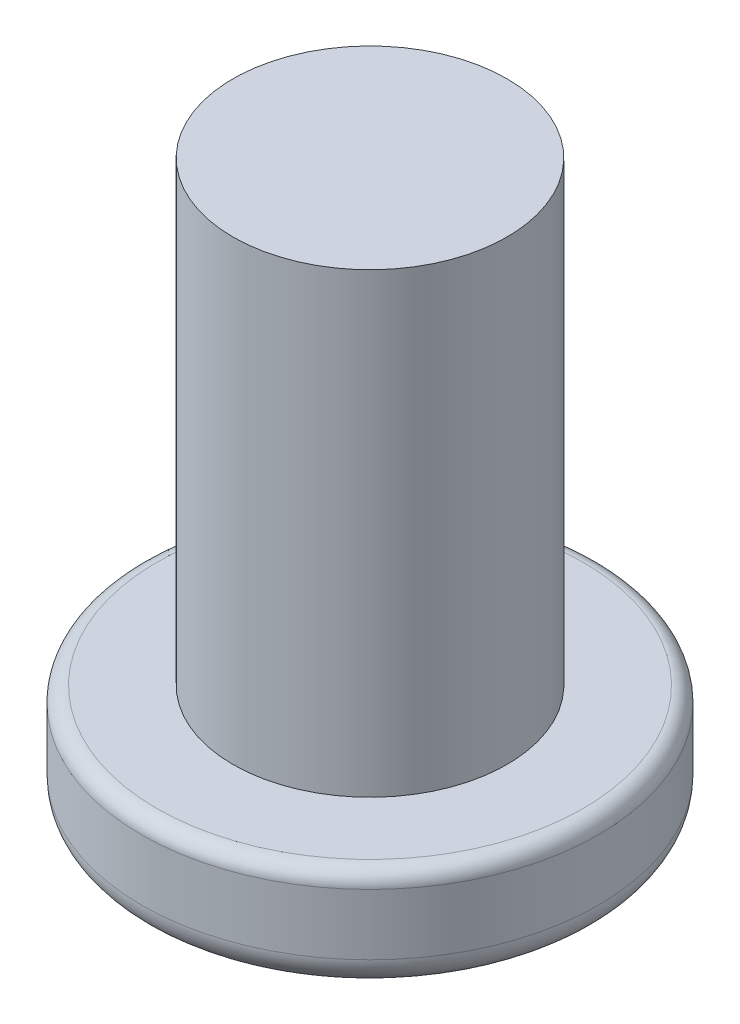
ISO-10303-21;
HEADER;
FILE_DESCRIPTION(('STEP AP214'),'2;1');
FILE_NAME('part.step','',(''),(''),'','','');
FILE_SCHEMA(('AUTOMOTIVE_DESIGN { 1 0 10303 214 1 1 1 1 }'));
ENDSEC;
DATA;
#1=APPLICATION_CONTEXT('core data for automotive mechanical design processes');
#2=APPLICATION_PROTOCOL_DEFINITION('international standard','automotive_design',2000,#1);
#3=PRODUCT_CONTEXT('',#1,'mechanical');
#4=PRODUCT('Part','Part','',(#3));
#5=PRODUCT_RELATED_PRODUCT_CATEGORY('part','',(#4));
#6=PRODUCT_DEFINITION_FORMATION('','',#4);
#7=PRODUCT_DEFINITION_CONTEXT('part definition',#1,'design');
#8=PRODUCT_DEFINITION('design','',#6,#7);
#9=PRODUCT_DEFINITION_SHAPE('','',#8);
#10=(LENGTH_UNIT() NAMED_UNIT(*) SI_UNIT(.MILLI.,.METRE.));
#11=(NAMED_UNIT(*) PLANE_ANGLE_UNIT() SI_UNIT($,.RADIAN.));
#12=(NAMED_UNIT(*) SI_UNIT($,.STERADIAN.) SOLID_ANGLE_UNIT());
#13=UNCERTAINTY_MEASURE_WITH_UNIT(LENGTH_MEASURE(1.E-05),#10,'distance_accuracy_value','');
#14=(GEOMETRIC_REPRESENTATION_CONTEXT(3) GLOBAL_UNCERTAINTY_ASSIGNED_CONTEXT((#13)) GLOBAL_UNIT_ASSIGNED_CONTEXT((#10,
#11,#12)) REPRESENTATION_CONTEXT('',''));
#15=CARTESIAN_POINT('',(0.,0.,0.));
#16=DIRECTION('',(0.,0.,1.));
#17=DIRECTION('',(1.,0.,0.));
#18=AXIS2_PLACEMENT_3D('',#15,#16,#17);
#19=CARTESIAN_POINT('',(0.,3.5,0.));
#20=DIRECTION('',(0.,-1.,0.));
#21=DIRECTION('',(0.,0.,-1.));
#22=AXIS2_PLACEMENT_3D('',#19,#20,#21);
#23=CYLINDRICAL_SURFACE('',#22,7.5);
#24=CARTESIAN_POINT('',(0.,3.,0.));
#25=DIRECTION('',(0.,1.,0.));
#26=DIRECTION('',(0.,0.,1.));
#27=AXIS2_PLACEMENT_3D('',#24,#25,#26);
#28=CIRCLE('',#27,7.5);
#29=CARTESIAN_POINT('',(0.,3.,7.5));
#30=VERTEX_POINT('',#29);
#31=EDGE_CURVE('E10',#30,#30,#28,.F.);
#32=ORIENTED_EDGE('',*,*,#31,.T.);
#33=EDGE_LOOP('',(#32));
#34=FACE_BOUND('',#33,.T.);
#35=CARTESIAN_POINT('',(0.,1.,0.));
#36=DIRECTION('',(0.,1.,0.));
#37=DIRECTION('',(0.,0.,1.));
#38=AXIS2_PLACEMENT_3D('',#35,#36,#37);
#39=CIRCLE('',#38,7.5);
#40=CARTESIAN_POINT('',(0.,1.,7.5));
#41=VERTEX_POINT('',#40);
#42=EDGE_CURVE('E55',#41,#41,#39,.T.);
#43=ORIENTED_EDGE('',*,*,#42,.T.);
#44=EDGE_LOOP('',(#43));
#45=FACE_BOUND('',#44,.T.);
#46=ADVANCED_FACE('F37',(#34,#45),#23,.T.);
#47=CARTESIAN_POINT('',(0.,3.5,0.));
#48=DIRECTION('',(0.,1.,0.));
#49=DIRECTION('',(0.,0.,1.));
#50=AXIS2_PLACEMENT_3D('',#47,#48,#49);
#51=PLANE('',#50);
#52=CARTESIAN_POINT('',(0.,3.5,0.));
#53=DIRECTION('',(0.,1.,0.));
#54=DIRECTION('',(0.,0.,1.));
#55=AXIS2_PLACEMENT_3D('',#52,#53,#54);
#56=CIRCLE('',#55,7.);
#57=CARTESIAN_POINT('',(0.,3.5,7.));
#58=VERTEX_POINT('',#57);
#59=EDGE_CURVE('E45',#58,#58,#56,.T.);
#60=ORIENTED_EDGE('',*,*,#59,.T.);
#61=EDGE_LOOP('',(#60));
#62=FACE_BOUND('',#61,.T.);
#63=CARTESIAN_POINT('',(0.,3.5,0.));
#64=DIRECTION('',(0.,1.,0.));
#65=DIRECTION('',(0.,0.,1.));
#66=AXIS2_PLACEMENT_3D('',#63,#64,#65);
#67=CIRCLE('',#66,4.5);
#68=CARTESIAN_POINT('',(0.,3.5,4.5));
#69=VERTEX_POINT('',#68);
#70=EDGE_CURVE('E61',#69,#69,#67,.T.);
#71=ORIENTED_EDGE('',*,*,#70,.F.);
#72=EDGE_LOOP('',(#71));
#73=FACE_BOUND('',#72,.T.);
#74=ADVANCED_FACE('F79',(#62,#73),#51,.T.);
#75=CARTESIAN_POINT('',(0.,0.,0.));
#76=DIRECTION('',(0.,1.,0.));
#77=DIRECTION('',(0.,0.,1.));
#78=AXIS2_PLACEMENT_3D('',#75,#76,#77);
#79=PLANE('',#78);
#80=CARTESIAN_POINT('',(0.,0.,0.));
#81=DIRECTION('',(0.,1.,0.));
#82=DIRECTION('',(0.,0.,1.));
#83=AXIS2_PLACEMENT_3D('',#80,#81,#82);
#84=CIRCLE('',#83,6.5);
#85=CARTESIAN_POINT('',(0.,0.,6.5));
#86=VERTEX_POINT('',#85);
#87=EDGE_CURVE('E50',#86,#86,#84,.F.);
#88=ORIENTED_EDGE('',*,*,#87,.T.);
#89=EDGE_LOOP('',(#88));
#90=FACE_BOUND('',#89,.T.);
#91=ADVANCED_FACE('F75',(#90),#79,.F.);
#92=CARTESIAN_POINT('',(0.,18.5,0.));
#93=DIRECTION('',(0.,-1.,0.));
#94=DIRECTION('',(0.,0.,-1.));
#95=AXIS2_PLACEMENT_3D('',#92,#93,#94);
#96=CYLINDRICAL_SURFACE('',#95,4.5);
#97=CARTESIAN_POINT('',(0.,18.5,0.));
#98=DIRECTION('',(0.,1.,0.));
#99=DIRECTION('',(0.,0.,1.));
#100=AXIS2_PLACEMENT_3D('',#97,#98,#99);
#101=CIRCLE('',#100,4.5);
#102=CARTESIAN_POINT('',(0.,18.5,4.5));
#103=VERTEX_POINT('',#102);
#104=EDGE_CURVE('E65',#103,#103,#101,.T.);
#105=ORIENTED_EDGE('',*,*,#104,.F.);
#106=EDGE_LOOP('',(#105));
#107=FACE_BOUND('',#106,.T.);
#108=ORIENTED_EDGE('',*,*,#70,.T.);
#109=EDGE_LOOP('',(#108));
#110=FACE_BOUND('',#109,.T.);
#111=ADVANCED_FACE('F72',(#107,#110),#96,.T.);
#112=CARTESIAN_POINT('',(0.,18.5,0.));
#113=DIRECTION('',(0.,1.,0.));
#114=DIRECTION('',(0.,0.,1.));
#115=AXIS2_PLACEMENT_3D('',#112,#113,#114);
#116=PLANE('',#115);
#117=ORIENTED_EDGE('',*,*,#104,.T.);
#118=EDGE_LOOP('',(#117));
#119=FACE_BOUND('',#118,.T.);
#120=ADVANCED_FACE('F70',(#119),#116,.T.);
#121=CARTESIAN_POINT('',(0.,1.,0.));
#122=DIRECTION('',(0.,1.,0.));
#123=DIRECTION('',(0.,0.,1.));
#124=AXIS2_PLACEMENT_3D('',#121,#122,#123);
#125=TOROIDAL_SURFACE('',#124,6.5,1.);
#126=ORIENTED_EDGE('',*,*,#87,.F.);
#127=EDGE_LOOP('',(#126));
#128=FACE_BOUND('',#127,.T.);
#129=ORIENTED_EDGE('',*,*,#42,.F.);
#130=EDGE_LOOP('',(#129));
#131=FACE_BOUND('',#130,.T.);
#132=ADVANCED_FACE('F90',(#128,#131),#125,.T.);
#133=CARTESIAN_POINT('',(0.,3.,0.));
#134=DIRECTION('',(0.,1.,0.));
#135=DIRECTION('',(0.,0.,1.));
#136=AXIS2_PLACEMENT_3D('',#133,#134,#135);
#137=TOROIDAL_SURFACE('',#136,7.,0.5);
#138=ORIENTED_EDGE('',*,*,#31,.F.);
#139=EDGE_LOOP('',(#138));
#140=FACE_BOUND('',#139,.T.);
#141=ORIENTED_EDGE('',*,*,#59,.F.);
#142=EDGE_LOOP('',(#141));
#143=FACE_BOUND('',#142,.T.);
#144=ADVANCED_FACE('F39',(#140,#143),#137,.T.);
#145=CLOSED_SHELL('',(#46,#74,#91,#111,#120,#132,#144));
#146=MANIFOLD_SOLID_BREP('B2',#145);
#147=ADVANCED_BREP_SHAPE_REPRESENTATION('',(#18,#146),#14);
#148=SHAPE_DEFINITION_REPRESENTATION(#9,#147);
ENDSEC;
END-ISO-10303-21;
